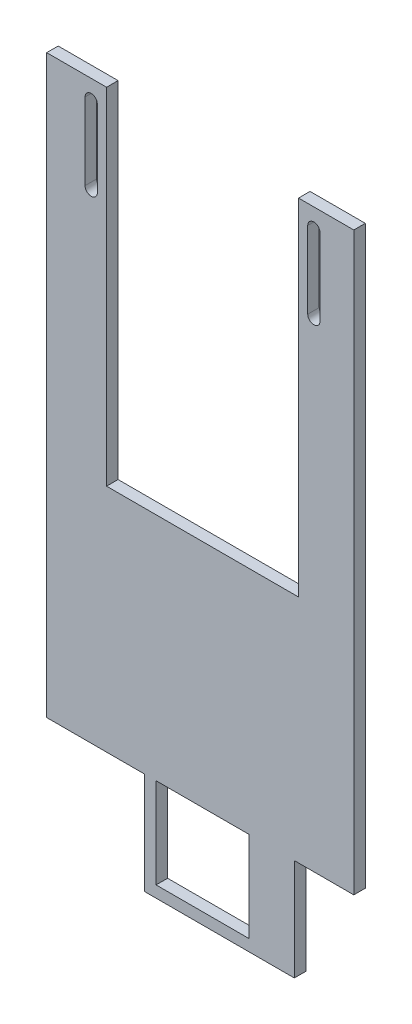
ISO-10303-21;
HEADER;
FILE_DESCRIPTION(('STEP AP214'),'2;1');
FILE_NAME('part.step','',(''),(''),'','','');
FILE_SCHEMA(('AUTOMOTIVE_DESIGN { 1 0 10303 214 1 1 1 1 }'));
ENDSEC;
DATA;
#1=APPLICATION_CONTEXT('core data for automotive mechanical design processes');
#2=APPLICATION_PROTOCOL_DEFINITION('international standard','automotive_design',2000,#1);
#3=PRODUCT_CONTEXT('',#1,'mechanical');
#4=PRODUCT('Part','Part','',(#3));
#5=PRODUCT_RELATED_PRODUCT_CATEGORY('part','',(#4));
#6=PRODUCT_DEFINITION_FORMATION('','',#4);
#7=PRODUCT_DEFINITION_CONTEXT('part definition',#1,'design');
#8=PRODUCT_DEFINITION('design','',#6,#7);
#9=PRODUCT_DEFINITION_SHAPE('','',#8);
#10=(LENGTH_UNIT() NAMED_UNIT(*) SI_UNIT(.MILLI.,.METRE.));
#11=(NAMED_UNIT(*) PLANE_ANGLE_UNIT() SI_UNIT($,.RADIAN.));
#12=(NAMED_UNIT(*) SI_UNIT($,.STERADIAN.) SOLID_ANGLE_UNIT());
#13=UNCERTAINTY_MEASURE_WITH_UNIT(LENGTH_MEASURE(1.E-05),#10,'distance_accuracy_value','');
#14=(GEOMETRIC_REPRESENTATION_CONTEXT(3) GLOBAL_UNCERTAINTY_ASSIGNED_CONTEXT((#13)) GLOBAL_UNIT_ASSIGNED_CONTEXT((#10,
#11,#12)) REPRESENTATION_CONTEXT('',''));
#15=CARTESIAN_POINT('',(0.,0.,0.));
#16=DIRECTION('',(0.,0.,1.));
#17=DIRECTION('',(1.,0.,0.));
#18=AXIS2_PLACEMENT_3D('',#15,#16,#17);
#19=CARTESIAN_POINT('',(0.,0.,3.));
#20=DIRECTION('',(0.,0.,1.));
#21=DIRECTION('',(1.,0.,0.));
#22=AXIS2_PLACEMENT_3D('',#19,#20,#21);
#23=PLANE('',#22);
#24=DIRECTION('',(0.,-1.,0.));
#25=VECTOR('',#24,1.);
#26=CARTESIAN_POINT('',(-30.9492647058823,17.9674201817482,3.));
#27=LINE('',#26,#25);
#28=CARTESIAN_POINT('',(-30.9492647058823,17.9674201817482,3.));
#29=VERTEX_POINT('',#28);
#30=CARTESIAN_POINT('',(-30.9492647058823,-132.032579818252,3.));
#31=VERTEX_POINT('',#30);
#32=EDGE_CURVE('E341',#29,#31,#27,.T.);
#33=ORIENTED_EDGE('',*,*,#32,.T.);
#34=DIRECTION('',(1.,0.,0.));
#35=VECTOR('',#34,1.);
#36=CARTESIAN_POINT('',(-30.9492647058823,-132.032579818252,3.));
#37=LINE('',#36,#35);
#38=CARTESIAN_POINT('',(-5.44926470588231,-132.032579818252,3.));
#39=VERTEX_POINT('',#38);
#40=EDGE_CURVE('E345',#31,#39,#37,.T.);
#41=ORIENTED_EDGE('',*,*,#40,.T.);
#42=DIRECTION('',(0.,-1.,0.));
#43=VECTOR('',#42,1.);
#44=CARTESIAN_POINT('',(-5.44926470588231,-132.032579818252,3.));
#45=LINE('',#44,#43);
#46=CARTESIAN_POINT('',(-5.44926470588231,-158.532579818252,3.));
#47=VERTEX_POINT('',#46);
#48=EDGE_CURVE('E349',#39,#47,#45,.T.);
#49=ORIENTED_EDGE('',*,*,#48,.T.);
#50=DIRECTION('',(1.,0.,0.));
#51=VECTOR('',#50,1.);
#52=CARTESIAN_POINT('',(-5.44926470588231,-158.532579818252,3.));
#53=LINE('',#52,#51);
#54=CARTESIAN_POINT('',(33.5507352941177,-158.532579818252,3.));
#55=VERTEX_POINT('',#54);
#56=EDGE_CURVE('E352',#47,#55,#53,.T.);
#57=ORIENTED_EDGE('',*,*,#56,.T.);
#58=DIRECTION('',(0.,1.,0.));
#59=VECTOR('',#58,1.);
#60=CARTESIAN_POINT('',(33.5507352941177,-158.532579818252,3.));
#61=LINE('',#60,#59);
#62=CARTESIAN_POINT('',(33.5507352941177,-132.032579818252,3.));
#63=VERTEX_POINT('',#62);
#64=EDGE_CURVE('E355',#55,#63,#61,.T.);
#65=ORIENTED_EDGE('',*,*,#64,.T.);
#66=DIRECTION('',(1.,0.,0.));
#67=VECTOR('',#66,1.);
#68=CARTESIAN_POINT('',(33.5507352941177,-132.032579818252,3.));
#69=LINE('',#68,#67);
#70=CARTESIAN_POINT('',(49.0507352941177,-132.032579818252,3.));
#71=VERTEX_POINT('',#70);
#72=EDGE_CURVE('E358',#63,#71,#69,.T.);
#73=ORIENTED_EDGE('',*,*,#72,.T.);
#74=DIRECTION('',(0.,1.,0.));
#75=VECTOR('',#74,1.);
#76=CARTESIAN_POINT('',(49.0507352941177,17.9674201817482,3.));
#77=LINE('',#76,#75);
#78=CARTESIAN_POINT('',(49.0507352941177,17.9674201817482,3.));
#79=VERTEX_POINT('',#78);
#80=EDGE_CURVE('E361',#71,#79,#77,.T.);
#81=ORIENTED_EDGE('',*,*,#80,.T.);
#82=DIRECTION('',(-1.,0.,0.));
#83=VECTOR('',#82,1.);
#84=CARTESIAN_POINT('',(34.6507352941177,17.9674201817482,3.));
#85=LINE('',#84,#83);
#86=CARTESIAN_POINT('',(34.6507352941177,17.9674201817482,3.));
#87=VERTEX_POINT('',#86);
#88=EDGE_CURVE('E364',#79,#87,#85,.T.);
#89=ORIENTED_EDGE('',*,*,#88,.T.);
#90=DIRECTION('',(0.,-1.,0.));
#91=VECTOR('',#90,1.);
#92=CARTESIAN_POINT('',(34.6507352941177,-8.71382331219959,3.));
#93=LINE('',#92,#91);
#94=CARTESIAN_POINT('',(34.6507352941177,-72.0325798182518,3.));
#95=VERTEX_POINT('',#94);
#96=EDGE_CURVE('E367',#87,#95,#93,.T.);
#97=ORIENTED_EDGE('',*,*,#96,.T.);
#98=DIRECTION('',(-1.,0.,0.));
#99=VECTOR('',#98,1.);
#100=CARTESIAN_POINT('',(-15.3492647058823,-72.0325798182518,3.));
#101=LINE('',#100,#99);
#102=CARTESIAN_POINT('',(-15.3492647058823,-72.0325798182518,3.));
#103=VERTEX_POINT('',#102);
#104=EDGE_CURVE('E370',#95,#103,#101,.T.);
#105=ORIENTED_EDGE('',*,*,#104,.T.);
#106=DIRECTION('',(0.,1.,0.));
#107=VECTOR('',#106,1.);
#108=CARTESIAN_POINT('',(-15.3492647058823,-8.71382331219959,3.));
#109=LINE('',#108,#107);
#110=CARTESIAN_POINT('',(-15.3492647058823,17.9674201817482,3.));
#111=VERTEX_POINT('',#110);
#112=EDGE_CURVE('E373',#103,#111,#109,.T.);
#113=ORIENTED_EDGE('',*,*,#112,.T.);
#114=DIRECTION('',(-1.,0.,0.));
#115=VECTOR('',#114,1.);
#116=CARTESIAN_POINT('',(-30.9492647058823,17.9674201817482,3.));
#117=LINE('',#116,#115);
#118=EDGE_CURVE('E376',#111,#29,#117,.T.);
#119=ORIENTED_EDGE('',*,*,#118,.T.);
#120=EDGE_LOOP('',(#33,#41,#49,#57,#65,#73,#81,#89,#97,#105,#113,#119));
#121=FACE_BOUND('',#120,.T.);
#122=DIRECTION('',(0.,-1.,0.));
#123=VECTOR('',#122,1.);
#124=CARTESIAN_POINT('',(-20.9492647058824,12.9674201817482,3.));
#125=LINE('',#124,#123);
#126=CARTESIAN_POINT('',(-20.9492647058824,12.9674201817482,3.));
#127=VERTEX_POINT('',#126);
#128=CARTESIAN_POINT('',(-20.9492647058824,-7.03257981825177,3.));
#129=VERTEX_POINT('',#128);
#130=EDGE_CURVE('E301',#127,#129,#125,.T.);
#131=ORIENTED_EDGE('',*,*,#130,.F.);
#132=CARTESIAN_POINT('',(-19.3492647058824,12.9674201817482,3.));
#133=DIRECTION('',(0.,0.,1.));
#134=DIRECTION('',(1.,0.,0.));
#135=AXIS2_PLACEMENT_3D('',#132,#133,#134);
#136=CIRCLE('',#135,1.6);
#137=CARTESIAN_POINT('',(-17.7492647058823,12.9674201817482,3.));
#138=VERTEX_POINT('',#137);
#139=EDGE_CURVE('E298',#138,#127,#136,.T.);
#140=ORIENTED_EDGE('',*,*,#139,.F.);
#141=DIRECTION('',(0.,1.,0.));
#142=VECTOR('',#141,1.);
#143=CARTESIAN_POINT('',(-17.7492647058823,12.9674201817482,3.));
#144=LINE('',#143,#142);
#145=CARTESIAN_POINT('',(-17.7492647058823,-7.03257981825177,3.));
#146=VERTEX_POINT('',#145);
#147=EDGE_CURVE('E309',#146,#138,#144,.T.);
#148=ORIENTED_EDGE('',*,*,#147,.F.);
#149=CARTESIAN_POINT('',(-19.3492647058823,-7.03257981825177,3.));
#150=DIRECTION('',(0.,0.,1.));
#151=DIRECTION('',(1.,0.,0.));
#152=AXIS2_PLACEMENT_3D('',#149,#150,#151);
#153=CIRCLE('',#152,1.60000000000001);
#154=EDGE_CURVE('E305',#129,#146,#153,.T.);
#155=ORIENTED_EDGE('',*,*,#154,.F.);
#156=EDGE_LOOP('',(#131,#140,#148,#155));
#157=FACE_BOUND('',#156,.T.);
#158=DIRECTION('',(0.,-1.,0.));
#159=VECTOR('',#158,1.);
#160=CARTESIAN_POINT('',(37.0507352941177,12.9674201817482,3.));
#161=LINE('',#160,#159);
#162=CARTESIAN_POINT('',(37.0507352941177,12.9674201817482,3.));
#163=VERTEX_POINT('',#162);
#164=CARTESIAN_POINT('',(37.0507352941177,-7.03257981825176,3.));
#165=VERTEX_POINT('',#164);
#166=EDGE_CURVE('E258',#163,#165,#161,.T.);
#167=ORIENTED_EDGE('',*,*,#166,.F.);
#168=CARTESIAN_POINT('',(38.6507352941177,12.9674201817482,3.));
#169=DIRECTION('',(0.,0.,1.));
#170=DIRECTION('',(-1.,0.,0.));
#171=AXIS2_PLACEMENT_3D('',#168,#169,#170);
#172=CIRCLE('',#171,1.6);
#173=CARTESIAN_POINT('',(40.2507352941177,12.9674201817482,3.));
#174=VERTEX_POINT('',#173);
#175=EDGE_CURVE('E255',#174,#163,#172,.T.);
#176=ORIENTED_EDGE('',*,*,#175,.F.);
#177=DIRECTION('',(0.,1.,0.));
#178=VECTOR('',#177,1.);
#179=CARTESIAN_POINT('',(40.2507352941177,12.9674201817482,3.));
#180=LINE('',#179,#178);
#181=CARTESIAN_POINT('',(40.2507352941177,-7.03257981825176,3.));
#182=VERTEX_POINT('',#181);
#183=EDGE_CURVE('E266',#182,#174,#180,.T.);
#184=ORIENTED_EDGE('',*,*,#183,.F.);
#185=CARTESIAN_POINT('',(38.6507352941177,-7.03257981825176,3.));
#186=DIRECTION('',(0.,0.,1.));
#187=DIRECTION('',(-1.,0.,0.));
#188=AXIS2_PLACEMENT_3D('',#185,#186,#187);
#189=CIRCLE('',#188,1.60000000000001);
#190=EDGE_CURVE('E262',#165,#182,#189,.T.);
#191=ORIENTED_EDGE('',*,*,#190,.F.);
#192=EDGE_LOOP('',(#167,#176,#184,#191));
#193=FACE_BOUND('',#192,.T.);
#194=DIRECTION('',(1.,0.,0.));
#195=VECTOR('',#194,1.);
#196=CARTESIAN_POINT('',(-2.44926470588231,-155.532579818252,3.));
#197=LINE('',#196,#195);
#198=CARTESIAN_POINT('',(-2.44926470588231,-155.532579818252,3.));
#199=VERTEX_POINT('',#198);
#200=CARTESIAN_POINT('',(21.7507352941177,-155.532579818252,3.));
#201=VERTEX_POINT('',#200);
#202=EDGE_CURVE('E216',#199,#201,#197,.T.);
#203=ORIENTED_EDGE('',*,*,#202,.F.);
#204=DIRECTION('',(0.,-1.,0.));
#205=VECTOR('',#204,1.);
#206=CARTESIAN_POINT('',(-2.44926470588231,-132.032579818252,3.));
#207=LINE('',#206,#205);
#208=CARTESIAN_POINT('',(-2.44926470588231,-132.032579818252,3.));
#209=VERTEX_POINT('',#208);
#210=EDGE_CURVE('E207',#209,#199,#207,.T.);
#211=ORIENTED_EDGE('',*,*,#210,.F.);
#212=DIRECTION('',(-1.,0.,0.));
#213=VECTOR('',#212,1.);
#214=CARTESIAN_POINT('',(-2.44926470588231,-132.032579818252,3.));
#215=LINE('',#214,#213);
#216=CARTESIAN_POINT('',(21.7507352941177,-132.032579818252,3.));
#217=VERTEX_POINT('',#216);
#218=EDGE_CURVE('E233',#217,#209,#215,.T.);
#219=ORIENTED_EDGE('',*,*,#218,.F.);
#220=DIRECTION('',(0.,1.,0.));
#221=VECTOR('',#220,1.);
#222=CARTESIAN_POINT('',(21.7507352941177,-155.532579818252,3.));
#223=LINE('',#222,#221);
#224=EDGE_CURVE('E229',#201,#217,#223,.T.);
#225=ORIENTED_EDGE('',*,*,#224,.F.);
#226=EDGE_LOOP('',(#203,#211,#219,#225));
#227=FACE_BOUND('',#226,.T.);
#228=ADVANCED_FACE('F45',(#121,#157,#193,#227),#23,.T.);
#229=CARTESIAN_POINT('',(0.,0.,0.));
#230=DIRECTION('',(0.,0.,1.));
#231=DIRECTION('',(1.,0.,0.));
#232=AXIS2_PLACEMENT_3D('',#229,#230,#231);
#233=PLANE('',#232);
#234=CARTESIAN_POINT('',(38.6507352941177,12.9674201817482,0.));
#235=DIRECTION('',(0.,0.,1.));
#236=DIRECTION('',(-1.,0.,0.));
#237=AXIS2_PLACEMENT_3D('',#234,#235,#236);
#238=CIRCLE('',#237,1.6);
#239=CARTESIAN_POINT('',(40.2507352941177,12.9674201817482,0.));
#240=VERTEX_POINT('',#239);
#241=CARTESIAN_POINT('',(37.0507352941177,12.9674201817482,0.));
#242=VERTEX_POINT('',#241);
#243=EDGE_CURVE('E225',#240,#242,#238,.T.);
#244=ORIENTED_EDGE('',*,*,#243,.T.);
#245=DIRECTION('',(0.,-1.,0.));
#246=VECTOR('',#245,1.);
#247=CARTESIAN_POINT('',(37.0507352941177,12.9674201817482,0.));
#248=LINE('',#247,#246);
#249=CARTESIAN_POINT('',(37.0507352941177,-7.03257981825176,0.));
#250=VERTEX_POINT('',#249);
#251=EDGE_CURVE('E273',#242,#250,#248,.T.);
#252=ORIENTED_EDGE('',*,*,#251,.T.);
#253=CARTESIAN_POINT('',(38.6507352941177,-7.03257981825176,0.));
#254=DIRECTION('',(0.,0.,1.));
#255=DIRECTION('',(-1.,0.,0.));
#256=AXIS2_PLACEMENT_3D('',#253,#254,#255);
#257=CIRCLE('',#256,1.60000000000001);
#258=CARTESIAN_POINT('',(40.2507352941177,-7.03257981825176,0.));
#259=VERTEX_POINT('',#258);
#260=EDGE_CURVE('E277',#250,#259,#257,.T.);
#261=ORIENTED_EDGE('',*,*,#260,.T.);
#262=DIRECTION('',(0.,1.,0.));
#263=VECTOR('',#262,1.);
#264=CARTESIAN_POINT('',(40.2507352941177,12.9674201817482,0.));
#265=LINE('',#264,#263);
#266=EDGE_CURVE('E259',#259,#240,#265,.T.);
#267=ORIENTED_EDGE('',*,*,#266,.T.);
#268=EDGE_LOOP('',(#244,#252,#261,#267));
#269=FACE_BOUND('',#268,.T.);
#270=DIRECTION('',(0.,-1.,0.));
#271=VECTOR('',#270,1.);
#272=CARTESIAN_POINT('',(-30.9492647058823,17.9674201817482,0.));
#273=LINE('',#272,#271);
#274=CARTESIAN_POINT('',(-30.9492647058823,17.9674201817482,0.));
#275=VERTEX_POINT('',#274);
#276=CARTESIAN_POINT('',(-30.9492647058823,-132.032579818252,0.));
#277=VERTEX_POINT('',#276);
#278=EDGE_CURVE('E340',#275,#277,#273,.T.);
#279=ORIENTED_EDGE('',*,*,#278,.F.);
#280=DIRECTION('',(-1.,0.,0.));
#281=VECTOR('',#280,1.);
#282=CARTESIAN_POINT('',(-30.9492647058823,17.9674201817482,0.));
#283=LINE('',#282,#281);
#284=CARTESIAN_POINT('',(-15.3492647058823,17.9674201817482,0.));
#285=VERTEX_POINT('',#284);
#286=EDGE_CURVE('E346',#285,#275,#283,.T.);
#287=ORIENTED_EDGE('',*,*,#286,.F.);
#288=DIRECTION('',(0.,1.,0.));
#289=VECTOR('',#288,1.);
#290=CARTESIAN_POINT('',(-15.3492647058823,-8.71382331219959,0.));
#291=LINE('',#290,#289);
#292=CARTESIAN_POINT('',(-15.3492647058823,-72.0325798182518,0.));
#293=VERTEX_POINT('',#292);
#294=EDGE_CURVE('E412',#293,#285,#291,.T.);
#295=ORIENTED_EDGE('',*,*,#294,.F.);
#296=DIRECTION('',(-1.,0.,0.));
#297=VECTOR('',#296,1.);
#298=CARTESIAN_POINT('',(-15.3492647058823,-72.0325798182518,0.));
#299=LINE('',#298,#297);
#300=CARTESIAN_POINT('',(34.6507352941177,-72.0325798182518,0.));
#301=VERTEX_POINT('',#300);
#302=EDGE_CURVE('E408',#301,#293,#299,.T.);
#303=ORIENTED_EDGE('',*,*,#302,.F.);
#304=DIRECTION('',(0.,-1.,0.));
#305=VECTOR('',#304,1.);
#306=CARTESIAN_POINT('',(34.6507352941177,-72.0325798182518,0.));
#307=LINE('',#306,#305);
#308=CARTESIAN_POINT('',(34.6507352941177,17.9674201817482,0.));
#309=VERTEX_POINT('',#308);
#310=EDGE_CURVE('E405',#309,#301,#307,.T.);
#311=ORIENTED_EDGE('',*,*,#310,.F.);
#312=DIRECTION('',(-1.,0.,0.));
#313=VECTOR('',#312,1.);
#314=CARTESIAN_POINT('',(34.6507352941177,17.9674201817482,0.));
#315=LINE('',#314,#313);
#316=CARTESIAN_POINT('',(49.0507352941177,17.9674201817482,0.));
#317=VERTEX_POINT('',#316);
#318=EDGE_CURVE('E401',#317,#309,#315,.T.);
#319=ORIENTED_EDGE('',*,*,#318,.F.);
#320=DIRECTION('',(0.,1.,0.));
#321=VECTOR('',#320,1.);
#322=CARTESIAN_POINT('',(49.0507352941177,17.9674201817482,0.));
#323=LINE('',#322,#321);
#324=CARTESIAN_POINT('',(49.0507352941177,-132.032579818252,0.));
#325=VERTEX_POINT('',#324);
#326=EDGE_CURVE('E398',#325,#317,#323,.T.);
#327=ORIENTED_EDGE('',*,*,#326,.F.);
#328=DIRECTION('',(1.,0.,0.));
#329=VECTOR('',#328,1.);
#330=CARTESIAN_POINT('',(33.5507352941177,-132.032579818252,0.));
#331=LINE('',#330,#329);
#332=CARTESIAN_POINT('',(33.5507352941177,-132.032579818252,0.));
#333=VERTEX_POINT('',#332);
#334=EDGE_CURVE('E395',#333,#325,#331,.T.);
#335=ORIENTED_EDGE('',*,*,#334,.F.);
#336=DIRECTION('',(0.,1.,0.));
#337=VECTOR('',#336,1.);
#338=CARTESIAN_POINT('',(33.5507352941177,-158.532579818252,0.));
#339=LINE('',#338,#337);
#340=CARTESIAN_POINT('',(33.5507352941177,-158.532579818252,0.));
#341=VERTEX_POINT('',#340);
#342=EDGE_CURVE('E392',#341,#333,#339,.T.);
#343=ORIENTED_EDGE('',*,*,#342,.F.);
#344=DIRECTION('',(1.,0.,0.));
#345=VECTOR('',#344,1.);
#346=CARTESIAN_POINT('',(-5.44926470588231,-158.532579818252,0.));
#347=LINE('',#346,#345);
#348=CARTESIAN_POINT('',(-5.44926470588231,-158.532579818252,0.));
#349=VERTEX_POINT('',#348);
#350=EDGE_CURVE('E389',#349,#341,#347,.T.);
#351=ORIENTED_EDGE('',*,*,#350,.F.);
#352=DIRECTION('',(0.,-1.,0.));
#353=VECTOR('',#352,1.);
#354=CARTESIAN_POINT('',(-5.44926470588231,-132.032579818252,0.));
#355=LINE('',#354,#353);
#356=CARTESIAN_POINT('',(-5.44926470588231,-132.032579818252,0.));
#357=VERTEX_POINT('',#356);
#358=EDGE_CURVE('E386',#357,#349,#355,.T.);
#359=ORIENTED_EDGE('',*,*,#358,.F.);
#360=DIRECTION('',(1.,0.,0.));
#361=VECTOR('',#360,1.);
#362=CARTESIAN_POINT('',(-30.9492647058823,-132.032579818252,0.));
#363=LINE('',#362,#361);
#364=EDGE_CURVE('E383',#277,#357,#363,.T.);
#365=ORIENTED_EDGE('',*,*,#364,.F.);
#366=EDGE_LOOP('',(#279,#287,#295,#303,#311,#319,#327,#335,#343,#351,#359,#365));
#367=FACE_BOUND('',#366,.T.);
#368=CARTESIAN_POINT('',(-19.3492647058824,12.9674201817482,0.));
#369=DIRECTION('',(0.,0.,1.));
#370=DIRECTION('',(1.,0.,0.));
#371=AXIS2_PLACEMENT_3D('',#368,#369,#370);
#372=CIRCLE('',#371,1.6);
#373=CARTESIAN_POINT('',(-17.7492647058823,12.9674201817482,0.));
#374=VERTEX_POINT('',#373);
#375=CARTESIAN_POINT('',(-20.9492647058824,12.9674201817482,0.));
#376=VERTEX_POINT('',#375);
#377=EDGE_CURVE('E297',#374,#376,#372,.T.);
#378=ORIENTED_EDGE('',*,*,#377,.T.);
#379=DIRECTION('',(0.,-1.,0.));
#380=VECTOR('',#379,1.);
#381=CARTESIAN_POINT('',(-20.9492647058824,12.9674201817482,0.));
#382=LINE('',#381,#380);
#383=CARTESIAN_POINT('',(-20.9492647058824,-7.03257981825177,0.));
#384=VERTEX_POINT('',#383);
#385=EDGE_CURVE('E316',#376,#384,#382,.T.);
#386=ORIENTED_EDGE('',*,*,#385,.T.);
#387=CARTESIAN_POINT('',(-19.3492647058823,-7.03257981825177,0.));
#388=DIRECTION('',(0.,0.,1.));
#389=DIRECTION('',(1.,0.,0.));
#390=AXIS2_PLACEMENT_3D('',#387,#388,#389);
#391=CIRCLE('',#390,1.60000000000001);
#392=CARTESIAN_POINT('',(-17.7492647058823,-7.03257981825177,0.));
#393=VERTEX_POINT('',#392);
#394=EDGE_CURVE('E320',#384,#393,#391,.T.);
#395=ORIENTED_EDGE('',*,*,#394,.T.);
#396=DIRECTION('',(0.,1.,0.));
#397=VECTOR('',#396,1.);
#398=CARTESIAN_POINT('',(-17.7492647058823,12.9674201817482,0.));
#399=LINE('',#398,#397);
#400=EDGE_CURVE('E302',#393,#374,#399,.T.);
#401=ORIENTED_EDGE('',*,*,#400,.T.);
#402=EDGE_LOOP('',(#378,#386,#395,#401));
#403=FACE_BOUND('',#402,.T.);
#404=DIRECTION('',(0.,-1.,0.));
#405=VECTOR('',#404,1.);
#406=CARTESIAN_POINT('',(-2.44926470588231,-132.032579818252,0.));
#407=LINE('',#406,#405);
#408=CARTESIAN_POINT('',(-2.44926470588231,-132.032579818252,0.));
#409=VERTEX_POINT('',#408);
#410=CARTESIAN_POINT('',(-2.44926470588231,-155.532579818252,0.));
#411=VERTEX_POINT('',#410);
#412=EDGE_CURVE('E69',#409,#411,#407,.T.);
#413=ORIENTED_EDGE('',*,*,#412,.T.);
#414=DIRECTION('',(1.,0.,0.));
#415=VECTOR('',#414,1.);
#416=CARTESIAN_POINT('',(-2.44926470588231,-155.532579818252,0.));
#417=LINE('',#416,#415);
#418=CARTESIAN_POINT('',(21.7507352941177,-155.532579818252,0.));
#419=VERTEX_POINT('',#418);
#420=EDGE_CURVE('E223',#411,#419,#417,.T.);
#421=ORIENTED_EDGE('',*,*,#420,.T.);
#422=DIRECTION('',(0.,1.,0.));
#423=VECTOR('',#422,1.);
#424=CARTESIAN_POINT('',(21.7507352941177,-155.532579818252,0.));
#425=LINE('',#424,#423);
#426=CARTESIAN_POINT('',(21.7507352941177,-132.032579818252,0.));
#427=VERTEX_POINT('',#426);
#428=EDGE_CURVE('E242',#419,#427,#425,.T.);
#429=ORIENTED_EDGE('',*,*,#428,.T.);
#430=DIRECTION('',(-1.,0.,0.));
#431=VECTOR('',#430,1.);
#432=CARTESIAN_POINT('',(-2.44926470588231,-132.032579818252,0.));
#433=LINE('',#432,#431);
#434=EDGE_CURVE('E217',#427,#409,#433,.T.);
#435=ORIENTED_EDGE('',*,*,#434,.T.);
#436=EDGE_LOOP('',(#413,#421,#429,#435));
#437=FACE_BOUND('',#436,.T.);
#438=ADVANCED_FACE('F467',(#269,#367,#403,#437),#233,.F.);
#439=CARTESIAN_POINT('',(-30.9492647058823,17.9674201817482,3.));
#440=DIRECTION('',(1.,0.,0.));
#441=DIRECTION('',(0.,1.,0.));
#442=AXIS2_PLACEMENT_3D('',#439,#440,#441);
#443=PLANE('',#442);
#444=ORIENTED_EDGE('',*,*,#278,.T.);
#445=DIRECTION('',(0.,0.,-1.));
#446=VECTOR('',#445,1.);
#447=CARTESIAN_POINT('',(-30.9492647058823,-132.032579818252,3.));
#448=LINE('',#447,#446);
#449=EDGE_CURVE('E11',#31,#277,#448,.T.);
#450=ORIENTED_EDGE('',*,*,#449,.F.);
#451=ORIENTED_EDGE('',*,*,#32,.F.);
#452=DIRECTION('',(0.,0.,-1.));
#453=VECTOR('',#452,1.);
#454=CARTESIAN_POINT('',(-30.9492647058823,17.9674201817482,3.));
#455=LINE('',#454,#453);
#456=EDGE_CURVE('E379',#29,#275,#455,.T.);
#457=ORIENTED_EDGE('',*,*,#456,.T.);
#458=EDGE_LOOP('',(#444,#450,#451,#457));
#459=FACE_BOUND('',#458,.T.);
#460=ADVANCED_FACE('F47',(#459),#443,.F.);
#461=CARTESIAN_POINT('',(-30.9492647058823,-132.032579818252,3.));
#462=DIRECTION('',(0.,1.,0.));
#463=DIRECTION('',(0.,0.,1.));
#464=AXIS2_PLACEMENT_3D('',#461,#462,#463);
#465=PLANE('',#464);
#466=ORIENTED_EDGE('',*,*,#364,.T.);
#467=DIRECTION('',(0.,0.,-1.));
#468=VECTOR('',#467,1.);
#469=CARTESIAN_POINT('',(-5.44926470588231,-132.032579818252,3.));
#470=LINE('',#469,#468);
#471=EDGE_CURVE('E54',#39,#357,#470,.T.);
#472=ORIENTED_EDGE('',*,*,#471,.F.);
#473=ORIENTED_EDGE('',*,*,#40,.F.);
#474=ORIENTED_EDGE('',*,*,#449,.T.);
#475=EDGE_LOOP('',(#466,#472,#473,#474));
#476=FACE_BOUND('',#475,.T.);
#477=ADVANCED_FACE('F485',(#476),#465,.F.);
#478=CARTESIAN_POINT('',(-5.44926470588231,-132.032579818252,3.));
#479=DIRECTION('',(1.,0.,0.));
#480=DIRECTION('',(0.,0.,-1.));
#481=AXIS2_PLACEMENT_3D('',#478,#479,#480);
#482=PLANE('',#481);
#483=ORIENTED_EDGE('',*,*,#358,.T.);
#484=DIRECTION('',(0.,0.,-1.));
#485=VECTOR('',#484,1.);
#486=CARTESIAN_POINT('',(-5.44926470588231,-158.532579818252,3.));
#487=LINE('',#486,#485);
#488=EDGE_CURVE('E452',#47,#349,#487,.T.);
#489=ORIENTED_EDGE('',*,*,#488,.F.);
#490=ORIENTED_EDGE('',*,*,#48,.F.);
#491=ORIENTED_EDGE('',*,*,#471,.T.);
#492=EDGE_LOOP('',(#483,#489,#490,#491));
#493=FACE_BOUND('',#492,.T.);
#494=ADVANCED_FACE('F461',(#493),#482,.F.);
#495=CARTESIAN_POINT('',(-5.44926470588231,-158.532579818252,3.));
#496=DIRECTION('',(0.,1.,0.));
#497=DIRECTION('',(0.,0.,1.));
#498=AXIS2_PLACEMENT_3D('',#495,#496,#497);
#499=PLANE('',#498);
#500=ORIENTED_EDGE('',*,*,#350,.T.);
#501=DIRECTION('',(0.,0.,-1.));
#502=VECTOR('',#501,1.);
#503=CARTESIAN_POINT('',(33.5507352941177,-158.532579818252,3.));
#504=LINE('',#503,#502);
#505=EDGE_CURVE('E448',#55,#341,#504,.T.);
#506=ORIENTED_EDGE('',*,*,#505,.F.);
#507=ORIENTED_EDGE('',*,*,#56,.F.);
#508=ORIENTED_EDGE('',*,*,#488,.T.);
#509=EDGE_LOOP('',(#500,#506,#507,#508));
#510=FACE_BOUND('',#509,.T.);
#511=ADVANCED_FACE('F473',(#510),#499,.F.);
#512=CARTESIAN_POINT('',(33.5507352941177,-158.532579818252,3.));
#513=DIRECTION('',(-1.,0.,0.));
#514=DIRECTION('',(0.,0.,1.));
#515=AXIS2_PLACEMENT_3D('',#512,#513,#514);
#516=PLANE('',#515);
#517=ORIENTED_EDGE('',*,*,#342,.T.);
#518=DIRECTION('',(0.,0.,-1.));
#519=VECTOR('',#518,1.);
#520=CARTESIAN_POINT('',(33.5507352941177,-132.032579818252,3.));
#521=LINE('',#520,#519);
#522=EDGE_CURVE('E444',#63,#333,#521,.T.);
#523=ORIENTED_EDGE('',*,*,#522,.F.);
#524=ORIENTED_EDGE('',*,*,#64,.F.);
#525=ORIENTED_EDGE('',*,*,#505,.T.);
#526=EDGE_LOOP('',(#517,#523,#524,#525));
#527=FACE_BOUND('',#526,.T.);
#528=ADVANCED_FACE('F477',(#527),#516,.F.);
#529=CARTESIAN_POINT('',(33.5507352941177,-132.032579818252,3.));
#530=DIRECTION('',(0.,1.,0.));
#531=DIRECTION('',(0.,0.,1.));
#532=AXIS2_PLACEMENT_3D('',#529,#530,#531);
#533=PLANE('',#532);
#534=ORIENTED_EDGE('',*,*,#334,.T.);
#535=DIRECTION('',(0.,0.,-1.));
#536=VECTOR('',#535,1.);
#537=CARTESIAN_POINT('',(49.0507352941177,-132.032579818252,3.));
#538=LINE('',#537,#536);
#539=EDGE_CURVE('E440',#71,#325,#538,.T.);
#540=ORIENTED_EDGE('',*,*,#539,.F.);
#541=ORIENTED_EDGE('',*,*,#72,.F.);
#542=ORIENTED_EDGE('',*,*,#522,.T.);
#543=EDGE_LOOP('',(#534,#540,#541,#542));
#544=FACE_BOUND('',#543,.T.);
#545=ADVANCED_FACE('F516',(#544),#533,.F.);
#546=CARTESIAN_POINT('',(49.0507352941177,17.9674201817482,3.));
#547=DIRECTION('',(-1.,0.,0.));
#548=DIRECTION('',(0.,-1.,0.));
#549=AXIS2_PLACEMENT_3D('',#546,#547,#548);
#550=PLANE('',#549);
#551=ORIENTED_EDGE('',*,*,#326,.T.);
#552=DIRECTION('',(0.,0.,-1.));
#553=VECTOR('',#552,1.);
#554=CARTESIAN_POINT('',(49.0507352941177,17.9674201817482,3.));
#555=LINE('',#554,#553);
#556=EDGE_CURVE('E436',#79,#317,#555,.T.);
#557=ORIENTED_EDGE('',*,*,#556,.F.);
#558=ORIENTED_EDGE('',*,*,#80,.F.);
#559=ORIENTED_EDGE('',*,*,#539,.T.);
#560=EDGE_LOOP('',(#551,#557,#558,#559));
#561=FACE_BOUND('',#560,.T.);
#562=ADVANCED_FACE('F514',(#561),#550,.F.);
#563=CARTESIAN_POINT('',(34.6507352941177,17.9674201817482,3.));
#564=DIRECTION('',(0.,-1.,0.));
#565=DIRECTION('',(1.,0.,0.));
#566=AXIS2_PLACEMENT_3D('',#563,#564,#565);
#567=PLANE('',#566);
#568=ORIENTED_EDGE('',*,*,#318,.T.);
#569=DIRECTION('',(0.,0.,-1.));
#570=VECTOR('',#569,1.);
#571=CARTESIAN_POINT('',(34.6507352941177,17.9674201817482,3.));
#572=LINE('',#571,#570);
#573=EDGE_CURVE('E432',#87,#309,#572,.T.);
#574=ORIENTED_EDGE('',*,*,#573,.F.);
#575=ORIENTED_EDGE('',*,*,#88,.F.);
#576=ORIENTED_EDGE('',*,*,#556,.T.);
#577=EDGE_LOOP('',(#568,#574,#575,#576));
#578=FACE_BOUND('',#577,.T.);
#579=ADVANCED_FACE('F507',(#578),#567,.F.);
#580=CARTESIAN_POINT('',(34.6507352941177,-72.0325798182518,3.));
#581=DIRECTION('',(1.,0.,0.));
#582=DIRECTION('',(0.,1.,0.));
#583=AXIS2_PLACEMENT_3D('',#580,#581,#582);
#584=PLANE('',#583);
#585=ORIENTED_EDGE('',*,*,#310,.T.);
#586=DIRECTION('',(0.,0.,-1.));
#587=VECTOR('',#586,1.);
#588=CARTESIAN_POINT('',(34.6507352941177,-72.0325798182518,3.));
#589=LINE('',#588,#587);
#590=EDGE_CURVE('E428',#95,#301,#589,.T.);
#591=ORIENTED_EDGE('',*,*,#590,.F.);
#592=ORIENTED_EDGE('',*,*,#96,.F.);
#593=ORIENTED_EDGE('',*,*,#573,.T.);
#594=EDGE_LOOP('',(#585,#591,#592,#593));
#595=FACE_BOUND('',#594,.T.);
#596=ADVANCED_FACE('F511',(#595),#584,.F.);
#597=CARTESIAN_POINT('',(-15.3492647058823,-72.0325798182518,3.));
#598=DIRECTION('',(0.,-1.,0.));
#599=DIRECTION('',(0.,0.,-1.));
#600=AXIS2_PLACEMENT_3D('',#597,#598,#599);
#601=PLANE('',#600);
#602=ORIENTED_EDGE('',*,*,#302,.T.);
#603=DIRECTION('',(0.,0.,-1.));
#604=VECTOR('',#603,1.);
#605=CARTESIAN_POINT('',(-15.3492647058823,-72.0325798182518,3.));
#606=LINE('',#605,#604);
#607=EDGE_CURVE('E424',#103,#293,#606,.T.);
#608=ORIENTED_EDGE('',*,*,#607,.F.);
#609=ORIENTED_EDGE('',*,*,#104,.F.);
#610=ORIENTED_EDGE('',*,*,#590,.T.);
#611=EDGE_LOOP('',(#602,#608,#609,#610));
#612=FACE_BOUND('',#611,.T.);
#613=ADVANCED_FACE('F500',(#612),#601,.F.);
#614=CARTESIAN_POINT('',(-15.3492647058823,-8.71382331219959,3.));
#615=DIRECTION('',(-1.,0.,0.));
#616=DIRECTION('',(0.,0.,1.));
#617=AXIS2_PLACEMENT_3D('',#614,#615,#616);
#618=PLANE('',#617);
#619=ORIENTED_EDGE('',*,*,#294,.T.);
#620=DIRECTION('',(0.,0.,-1.));
#621=VECTOR('',#620,1.);
#622=CARTESIAN_POINT('',(-15.3492647058823,17.9674201817482,3.));
#623=LINE('',#622,#621);
#624=EDGE_CURVE('E420',#111,#285,#623,.T.);
#625=ORIENTED_EDGE('',*,*,#624,.F.);
#626=ORIENTED_EDGE('',*,*,#112,.F.);
#627=ORIENTED_EDGE('',*,*,#607,.T.);
#628=EDGE_LOOP('',(#619,#625,#626,#627));
#629=FACE_BOUND('',#628,.T.);
#630=ADVANCED_FACE('F496',(#629),#618,.F.);
#631=CARTESIAN_POINT('',(-30.9492647058823,17.9674201817482,3.));
#632=DIRECTION('',(0.,-1.,0.));
#633=DIRECTION('',(0.,0.,-1.));
#634=AXIS2_PLACEMENT_3D('',#631,#632,#633);
#635=PLANE('',#634);
#636=ORIENTED_EDGE('',*,*,#286,.T.);
#637=ORIENTED_EDGE('',*,*,#456,.F.);
#638=ORIENTED_EDGE('',*,*,#118,.F.);
#639=ORIENTED_EDGE('',*,*,#624,.T.);
#640=EDGE_LOOP('',(#636,#637,#638,#639));
#641=FACE_BOUND('',#640,.T.);
#642=ADVANCED_FACE('F491',(#641),#635,.F.);
#643=CARTESIAN_POINT('',(-19.3492647058824,12.9674201817482,3.));
#644=DIRECTION('',(0.,0.,-1.));
#645=DIRECTION('',(-1.,0.,0.));
#646=AXIS2_PLACEMENT_3D('',#643,#644,#645);
#647=CYLINDRICAL_SURFACE('',#646,1.6);
#648=ORIENTED_EDGE('',*,*,#377,.F.);
#649=DIRECTION('',(0.,0.,-1.));
#650=VECTOR('',#649,1.);
#651=CARTESIAN_POINT('',(-17.7492647058823,12.9674201817482,3.));
#652=LINE('',#651,#650);
#653=EDGE_CURVE('E312',#138,#374,#652,.T.);
#654=ORIENTED_EDGE('',*,*,#653,.F.);
#655=ORIENTED_EDGE('',*,*,#139,.T.);
#656=DIRECTION('',(0.,0.,-1.));
#657=VECTOR('',#656,1.);
#658=CARTESIAN_POINT('',(-20.9492647058824,12.9674201817482,3.));
#659=LINE('',#658,#657);
#660=EDGE_CURVE('E336',#127,#376,#659,.T.);
#661=ORIENTED_EDGE('',*,*,#660,.T.);
#662=EDGE_LOOP('',(#648,#654,#655,#661));
#663=FACE_BOUND('',#662,.T.);
#664=ADVANCED_FACE('F533',(#663),#647,.F.);
#665=CARTESIAN_POINT('',(-20.9492647058824,12.9674201817482,3.));
#666=DIRECTION('',(1.,0.,0.));
#667=DIRECTION('',(0.,0.,-1.));
#668=AXIS2_PLACEMENT_3D('',#665,#666,#667);
#669=PLANE('',#668);
#670=ORIENTED_EDGE('',*,*,#385,.F.);
#671=ORIENTED_EDGE('',*,*,#660,.F.);
#672=ORIENTED_EDGE('',*,*,#130,.T.);
#673=DIRECTION('',(0.,0.,-1.));
#674=VECTOR('',#673,1.);
#675=CARTESIAN_POINT('',(-20.9492647058824,-7.03257981825177,3.));
#676=LINE('',#675,#674);
#677=EDGE_CURVE('E333',#129,#384,#676,.T.);
#678=ORIENTED_EDGE('',*,*,#677,.T.);
#679=EDGE_LOOP('',(#670,#671,#672,#678));
#680=FACE_BOUND('',#679,.T.);
#681=ADVANCED_FACE('F576',(#680),#669,.T.);
#682=CARTESIAN_POINT('',(-19.3492647058823,-7.03257981825177,3.));
#683=DIRECTION('',(0.,0.,-1.));
#684=DIRECTION('',(-1.,0.,0.));
#685=AXIS2_PLACEMENT_3D('',#682,#683,#684);
#686=CYLINDRICAL_SURFACE('',#685,1.60000000000001);
#687=ORIENTED_EDGE('',*,*,#394,.F.);
#688=ORIENTED_EDGE('',*,*,#677,.F.);
#689=ORIENTED_EDGE('',*,*,#154,.T.);
#690=DIRECTION('',(0.,0.,-1.));
#691=VECTOR('',#690,1.);
#692=CARTESIAN_POINT('',(-17.7492647058823,-7.03257981825177,3.));
#693=LINE('',#692,#691);
#694=EDGE_CURVE('E330',#146,#393,#693,.T.);
#695=ORIENTED_EDGE('',*,*,#694,.T.);
#696=EDGE_LOOP('',(#687,#688,#689,#695));
#697=FACE_BOUND('',#696,.T.);
#698=ADVANCED_FACE('F584',(#697),#686,.F.);
#699=CARTESIAN_POINT('',(-17.7492647058823,12.9674201817482,3.));
#700=DIRECTION('',(-1.,0.,0.));
#701=DIRECTION('',(0.,-1.,0.));
#702=AXIS2_PLACEMENT_3D('',#699,#700,#701);
#703=PLANE('',#702);
#704=ORIENTED_EDGE('',*,*,#400,.F.);
#705=ORIENTED_EDGE('',*,*,#694,.F.);
#706=ORIENTED_EDGE('',*,*,#147,.T.);
#707=ORIENTED_EDGE('',*,*,#653,.T.);
#708=EDGE_LOOP('',(#704,#705,#706,#707));
#709=FACE_BOUND('',#708,.T.);
#710=ADVANCED_FACE('F592',(#709),#703,.T.);
#711=CARTESIAN_POINT('',(38.6507352941177,12.9674201817482,3.));
#712=DIRECTION('',(0.,0.,-1.));
#713=DIRECTION('',(-1.,0.,0.));
#714=AXIS2_PLACEMENT_3D('',#711,#712,#713);
#715=CYLINDRICAL_SURFACE('',#714,1.6);
#716=ORIENTED_EDGE('',*,*,#243,.F.);
#717=DIRECTION('',(0.,0.,-1.));
#718=VECTOR('',#717,1.);
#719=CARTESIAN_POINT('',(40.2507352941177,12.9674201817482,3.));
#720=LINE('',#719,#718);
#721=EDGE_CURVE('E269',#174,#240,#720,.T.);
#722=ORIENTED_EDGE('',*,*,#721,.F.);
#723=ORIENTED_EDGE('',*,*,#175,.T.);
#724=DIRECTION('',(0.,0.,-1.));
#725=VECTOR('',#724,1.);
#726=CARTESIAN_POINT('',(37.0507352941177,12.9674201817482,3.));
#727=LINE('',#726,#725);
#728=EDGE_CURVE('E293',#163,#242,#727,.T.);
#729=ORIENTED_EDGE('',*,*,#728,.T.);
#730=EDGE_LOOP('',(#716,#722,#723,#729));
#731=FACE_BOUND('',#730,.T.);
#732=ADVANCED_FACE('F601',(#731),#715,.F.);
#733=CARTESIAN_POINT('',(37.0507352941177,12.9674201817482,3.));
#734=DIRECTION('',(1.,0.,0.));
#735=DIRECTION('',(0.,0.,-1.));
#736=AXIS2_PLACEMENT_3D('',#733,#734,#735);
#737=PLANE('',#736);
#738=ORIENTED_EDGE('',*,*,#251,.F.);
#739=ORIENTED_EDGE('',*,*,#728,.F.);
#740=ORIENTED_EDGE('',*,*,#166,.T.);
#741=DIRECTION('',(0.,0.,-1.));
#742=VECTOR('',#741,1.);
#743=CARTESIAN_POINT('',(37.0507352941177,-7.03257981825176,3.));
#744=LINE('',#743,#742);
#745=EDGE_CURVE('E290',#165,#250,#744,.T.);
#746=ORIENTED_EDGE('',*,*,#745,.T.);
#747=EDGE_LOOP('',(#738,#739,#740,#746));
#748=FACE_BOUND('',#747,.T.);
#749=ADVANCED_FACE('F610',(#748),#737,.T.);
#750=CARTESIAN_POINT('',(38.6507352941177,-7.03257981825176,3.));
#751=DIRECTION('',(0.,0.,-1.));
#752=DIRECTION('',(-1.,0.,0.));
#753=AXIS2_PLACEMENT_3D('',#750,#751,#752);
#754=CYLINDRICAL_SURFACE('',#753,1.60000000000001);
#755=ORIENTED_EDGE('',*,*,#260,.F.);
#756=ORIENTED_EDGE('',*,*,#745,.F.);
#757=ORIENTED_EDGE('',*,*,#190,.T.);
#758=DIRECTION('',(0.,0.,-1.));
#759=VECTOR('',#758,1.);
#760=CARTESIAN_POINT('',(40.2507352941177,-7.03257981825176,3.));
#761=LINE('',#760,#759);
#762=EDGE_CURVE('E287',#182,#259,#761,.T.);
#763=ORIENTED_EDGE('',*,*,#762,.T.);
#764=EDGE_LOOP('',(#755,#756,#757,#763));
#765=FACE_BOUND('',#764,.T.);
#766=ADVANCED_FACE('F619',(#765),#754,.F.);
#767=CARTESIAN_POINT('',(40.2507352941177,12.9674201817482,3.));
#768=DIRECTION('',(-1.,0.,0.));
#769=DIRECTION('',(0.,-1.,0.));
#770=AXIS2_PLACEMENT_3D('',#767,#768,#769);
#771=PLANE('',#770);
#772=ORIENTED_EDGE('',*,*,#266,.F.);
#773=ORIENTED_EDGE('',*,*,#762,.F.);
#774=ORIENTED_EDGE('',*,*,#183,.T.);
#775=ORIENTED_EDGE('',*,*,#721,.T.);
#776=EDGE_LOOP('',(#772,#773,#774,#775));
#777=FACE_BOUND('',#776,.T.);
#778=ADVANCED_FACE('F628',(#777),#771,.T.);
#779=CARTESIAN_POINT('',(-2.44926470588231,-132.032579818252,3.));
#780=DIRECTION('',(1.,0.,0.));
#781=DIRECTION('',(0.,0.,-1.));
#782=AXIS2_PLACEMENT_3D('',#779,#780,#781);
#783=PLANE('',#782);
#784=ORIENTED_EDGE('',*,*,#412,.F.);
#785=DIRECTION('',(0.,0.,-1.));
#786=VECTOR('',#785,1.);
#787=CARTESIAN_POINT('',(-2.44926470588231,-132.032579818252,3.));
#788=LINE('',#787,#786);
#789=EDGE_CURVE('E211',#209,#409,#788,.T.);
#790=ORIENTED_EDGE('',*,*,#789,.F.);
#791=ORIENTED_EDGE('',*,*,#210,.T.);
#792=DIRECTION('',(0.,0.,-1.));
#793=VECTOR('',#792,1.);
#794=CARTESIAN_POINT('',(-2.44926470588231,-155.532579818252,3.));
#795=LINE('',#794,#793);
#796=EDGE_CURVE('E210',#199,#411,#795,.T.);
#797=ORIENTED_EDGE('',*,*,#796,.T.);
#798=EDGE_LOOP('',(#784,#790,#791,#797));
#799=FACE_BOUND('',#798,.T.);
#800=ADVANCED_FACE('F209',(#799),#783,.T.);
#801=CARTESIAN_POINT('',(-2.44926470588231,-155.532579818252,3.));
#802=DIRECTION('',(0.,1.,0.));
#803=DIRECTION('',(0.,0.,1.));
#804=AXIS2_PLACEMENT_3D('',#801,#802,#803);
#805=PLANE('',#804);
#806=ORIENTED_EDGE('',*,*,#420,.F.);
#807=ORIENTED_EDGE('',*,*,#796,.F.);
#808=ORIENTED_EDGE('',*,*,#202,.T.);
#809=DIRECTION('',(0.,0.,-1.));
#810=VECTOR('',#809,1.);
#811=CARTESIAN_POINT('',(21.7507352941177,-155.532579818252,3.));
#812=LINE('',#811,#810);
#813=EDGE_CURVE('E226',#201,#419,#812,.T.);
#814=ORIENTED_EDGE('',*,*,#813,.T.);
#815=EDGE_LOOP('',(#806,#807,#808,#814));
#816=FACE_BOUND('',#815,.T.);
#817=ADVANCED_FACE('F220',(#816),#805,.T.);
#818=CARTESIAN_POINT('',(21.7507352941177,-155.532579818252,3.));
#819=DIRECTION('',(-1.,0.,0.));
#820=DIRECTION('',(0.,0.,1.));
#821=AXIS2_PLACEMENT_3D('',#818,#819,#820);
#822=PLANE('',#821);
#823=ORIENTED_EDGE('',*,*,#428,.F.);
#824=ORIENTED_EDGE('',*,*,#813,.F.);
#825=ORIENTED_EDGE('',*,*,#224,.T.);
#826=DIRECTION('',(0.,0.,-1.));
#827=VECTOR('',#826,1.);
#828=CARTESIAN_POINT('',(21.7507352941177,-132.032579818252,3.));
#829=LINE('',#828,#827);
#830=EDGE_CURVE('E61',#217,#427,#829,.T.);
#831=ORIENTED_EDGE('',*,*,#830,.T.);
#832=EDGE_LOOP('',(#823,#824,#825,#831));
#833=FACE_BOUND('',#832,.T.);
#834=ADVANCED_FACE('F652',(#833),#822,.T.);
#835=CARTESIAN_POINT('',(-2.44926470588231,-132.032579818252,3.));
#836=DIRECTION('',(0.,-1.,0.));
#837=DIRECTION('',(0.,0.,-1.));
#838=AXIS2_PLACEMENT_3D('',#835,#836,#837);
#839=PLANE('',#838);
#840=ORIENTED_EDGE('',*,*,#434,.F.);
#841=ORIENTED_EDGE('',*,*,#830,.F.);
#842=ORIENTED_EDGE('',*,*,#218,.T.);
#843=ORIENTED_EDGE('',*,*,#789,.T.);
#844=EDGE_LOOP('',(#840,#841,#842,#843));
#845=FACE_BOUND('',#844,.T.);
#846=ADVANCED_FACE('F660',(#845),#839,.T.);
#847=CLOSED_SHELL('',(#228,#438,#460,#477,#494,#511,#528,#545,#562,#579,#596,#613,#630,#642,
#664,#681,#698,#710,#732,#749,#766,#778,#800,#817,#834,#846));
#848=MANIFOLD_SOLID_BREP('B2',#847);
#849=ADVANCED_BREP_SHAPE_REPRESENTATION('',(#18,#848),#14);
#850=SHAPE_DEFINITION_REPRESENTATION(#9,#849);
ENDSEC;
END-ISO-10303-21;
